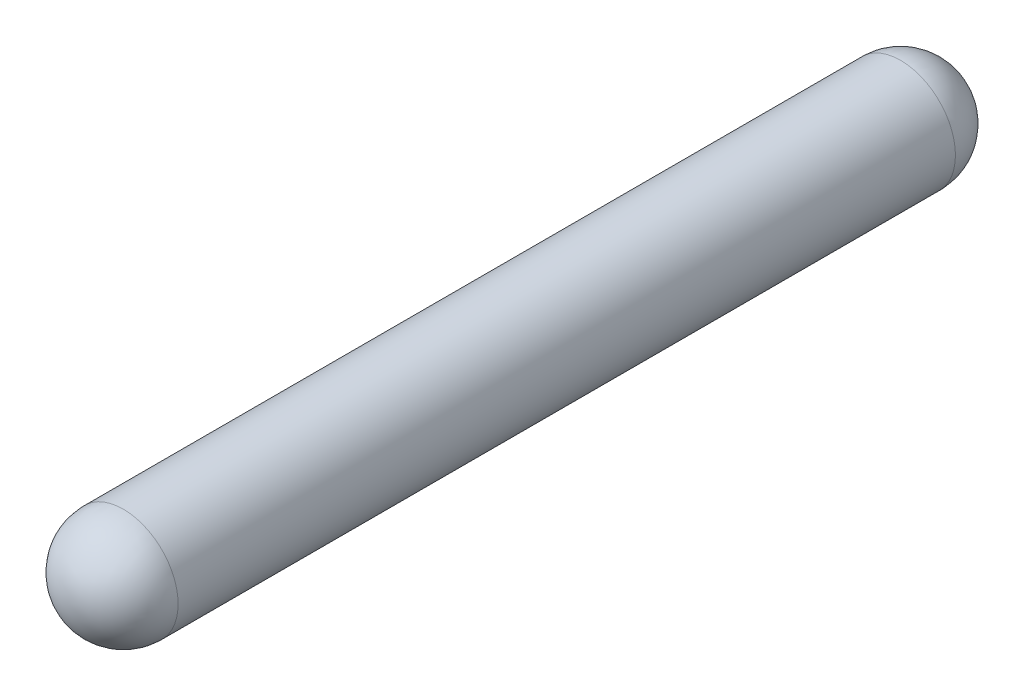
ISO-10303-21;
HEADER;
FILE_DESCRIPTION(('STEP AP214'),'2;1');
FILE_NAME('part.step','',(''),(''),'','','');
FILE_SCHEMA(('AUTOMOTIVE_DESIGN { 1 0 10303 214 1 1 1 1 }'));
ENDSEC;
DATA;
#1=APPLICATION_CONTEXT('core data for automotive mechanical design processes');
#2=APPLICATION_PROTOCOL_DEFINITION('international standard','automotive_design',2000,#1);
#3=PRODUCT_CONTEXT('',#1,'mechanical');
#4=PRODUCT('Part','Part','',(#3));
#5=PRODUCT_RELATED_PRODUCT_CATEGORY('part','',(#4));
#6=PRODUCT_DEFINITION_FORMATION('','',#4);
#7=PRODUCT_DEFINITION_CONTEXT('part definition',#1,'design');
#8=PRODUCT_DEFINITION('design','',#6,#7);
#9=PRODUCT_DEFINITION_SHAPE('','',#8);
#10=(LENGTH_UNIT() NAMED_UNIT(*) SI_UNIT(.MILLI.,.METRE.));
#11=(NAMED_UNIT(*) PLANE_ANGLE_UNIT() SI_UNIT($,.RADIAN.));
#12=(NAMED_UNIT(*) SI_UNIT($,.STERADIAN.) SOLID_ANGLE_UNIT());
#13=UNCERTAINTY_MEASURE_WITH_UNIT(LENGTH_MEASURE(1.E-05),#10,'distance_accuracy_value','');
#14=(GEOMETRIC_REPRESENTATION_CONTEXT(3) GLOBAL_UNCERTAINTY_ASSIGNED_CONTEXT((#13)) GLOBAL_UNIT_ASSIGNED_CONTEXT((#10,
#11,#12)) REPRESENTATION_CONTEXT('',''));
#15=CARTESIAN_POINT('',(0.,0.,0.));
#16=DIRECTION('',(0.,0.,1.));
#17=DIRECTION('',(1.,0.,0.));
#18=AXIS2_PLACEMENT_3D('',#15,#16,#17);
#19=CARTESIAN_POINT('',(2.54,2.54,-3.));
#20=DIRECTION('',(1.,0.,0.));
#21=DIRECTION('',(0.,-1.,0.));
#22=AXIS2_PLACEMENT_3D('',#19,#20,#21);
#23=SPHERICAL_SURFACE('',#22,0.458);
#24=CARTESIAN_POINT('',(2.54,2.54,-3.));
#25=DIRECTION('',(0.,0.,1.));
#26=DIRECTION('',(1.,0.,0.));
#27=AXIS2_PLACEMENT_3D('',#24,#25,#26);
#28=CIRCLE('',#27,0.458);
#29=CARTESIAN_POINT('',(2.998,2.54,-3.));
#30=VERTEX_POINT('',#29);
#31=CARTESIAN_POINT('',(2.082,2.54,-3.));
#32=VERTEX_POINT('',#31);
#33=EDGE_CURVE('E42',#30,#32,#28,.T.);
#34=ORIENTED_EDGE('',*,*,#33,.F.);
#35=CARTESIAN_POINT('',(2.54,2.54,-3.));
#36=DIRECTION('',(0.,0.,1.));
#37=DIRECTION('',(1.,0.,0.));
#38=AXIS2_PLACEMENT_3D('',#35,#36,#37);
#39=CIRCLE('',#38,0.458);
#40=EDGE_CURVE('E26',#32,#30,#39,.T.);
#41=ORIENTED_EDGE('',*,*,#40,.F.);
#42=EDGE_LOOP('',(#34,#41));
#43=FACE_BOUND('',#42,.T.);
#44=ADVANCED_FACE('F17',(#43),#23,.T.);
#45=CARTESIAN_POINT('',(2.54,2.54,3.5));
#46=DIRECTION('',(1.,0.,0.));
#47=DIRECTION('',(0.,1.,0.));
#48=AXIS2_PLACEMENT_3D('',#45,#46,#47);
#49=SPHERICAL_SURFACE('',#48,0.458);
#50=CARTESIAN_POINT('',(2.54,2.54,3.5));
#51=DIRECTION('',(0.,0.,1.));
#52=DIRECTION('',(1.,0.,0.));
#53=AXIS2_PLACEMENT_3D('',#50,#51,#52);
#54=CIRCLE('',#53,0.458);
#55=CARTESIAN_POINT('',(2.998,2.54,3.5));
#56=VERTEX_POINT('',#55);
#57=CARTESIAN_POINT('',(2.082,2.54,3.5));
#58=VERTEX_POINT('',#57);
#59=EDGE_CURVE('E11',#56,#58,#54,.F.);
#60=ORIENTED_EDGE('',*,*,#59,.F.);
#61=CARTESIAN_POINT('',(2.54,2.54,3.5));
#62=DIRECTION('',(0.,0.,1.));
#63=DIRECTION('',(1.,0.,0.));
#64=AXIS2_PLACEMENT_3D('',#61,#62,#63);
#65=CIRCLE('',#64,0.458);
#66=EDGE_CURVE('E34',#58,#56,#65,.F.);
#67=ORIENTED_EDGE('',*,*,#66,.F.);
#68=EDGE_LOOP('',(#60,#67));
#69=FACE_BOUND('',#68,.T.);
#70=ADVANCED_FACE('F49',(#69),#49,.T.);
#71=CARTESIAN_POINT('',(2.54,2.54,-3.));
#72=DIRECTION('',(0.,0.,1.));
#73=DIRECTION('',(1.,0.,0.));
#74=AXIS2_PLACEMENT_3D('',#71,#72,#73);
#75=CYLINDRICAL_SURFACE('',#74,0.458);
#76=ORIENTED_EDGE('',*,*,#66,.T.);
#77=ORIENTED_EDGE('',*,*,#59,.T.);
#78=EDGE_LOOP('',(#76,#77));
#79=FACE_BOUND('',#78,.T.);
#80=ORIENTED_EDGE('',*,*,#40,.T.);
#81=ORIENTED_EDGE('',*,*,#33,.T.);
#82=EDGE_LOOP('',(#80,#81));
#83=FACE_BOUND('',#82,.T.);
#84=ADVANCED_FACE('F45',(#79,#83),#75,.T.);
#85=CLOSED_SHELL('',(#44,#70,#84));
#86=MANIFOLD_SOLID_BREP('B1',#85);
#87=ADVANCED_BREP_SHAPE_REPRESENTATION('',(#18,#86),#14);
#88=SHAPE_DEFINITION_REPRESENTATION(#9,#87);
ENDSEC;
END-ISO-10303-21;
